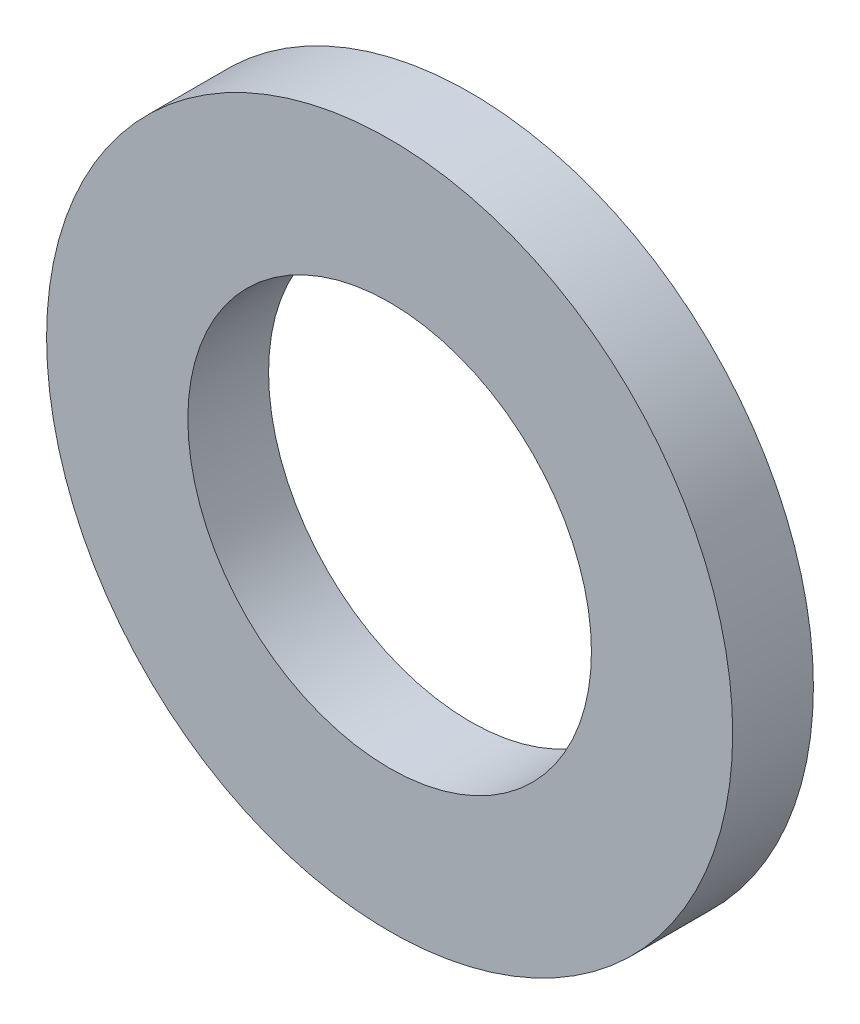
ISO-10303-21;
HEADER;
FILE_DESCRIPTION(('STEP AP214'),'2;1');
FILE_NAME('part.step','',(''),(''),'','','');
FILE_SCHEMA(('AUTOMOTIVE_DESIGN { 1 0 10303 214 1 1 1 1 }'));
ENDSEC;
DATA;
#1=APPLICATION_CONTEXT('core data for automotive mechanical design processes');
#2=APPLICATION_PROTOCOL_DEFINITION('international standard','automotive_design',2000,#1);
#3=PRODUCT_CONTEXT('',#1,'mechanical');
#4=PRODUCT('Part','Part','',(#3));
#5=PRODUCT_RELATED_PRODUCT_CATEGORY('part','',(#4));
#6=PRODUCT_DEFINITION_FORMATION('','',#4);
#7=PRODUCT_DEFINITION_CONTEXT('part definition',#1,'design');
#8=PRODUCT_DEFINITION('design','',#6,#7);
#9=PRODUCT_DEFINITION_SHAPE('','',#8);
#10=(LENGTH_UNIT() NAMED_UNIT(*) SI_UNIT(.MILLI.,.METRE.));
#11=(NAMED_UNIT(*) PLANE_ANGLE_UNIT() SI_UNIT($,.RADIAN.));
#12=(NAMED_UNIT(*) SI_UNIT($,.STERADIAN.) SOLID_ANGLE_UNIT());
#13=UNCERTAINTY_MEASURE_WITH_UNIT(LENGTH_MEASURE(1.E-05),#10,'distance_accuracy_value','');
#14=(GEOMETRIC_REPRESENTATION_CONTEXT(3) GLOBAL_UNCERTAINTY_ASSIGNED_CONTEXT((#13)) GLOBAL_UNIT_ASSIGNED_CONTEXT((#10,
#11,#12)) REPRESENTATION_CONTEXT('',''));
#15=CARTESIAN_POINT('',(0.,0.,0.));
#16=DIRECTION('',(0.,0.,1.));
#17=DIRECTION('',(1.,0.,0.));
#18=AXIS2_PLACEMENT_3D('',#15,#16,#17);
#19=CARTESIAN_POINT('',(0.,0.,1.));
#20=DIRECTION('',(0.,0.,1.));
#21=DIRECTION('',(1.,0.,0.));
#22=AXIS2_PLACEMENT_3D('',#19,#20,#21);
#23=PLANE('',#22);
#24=CARTESIAN_POINT('',(0.,0.,1.));
#25=DIRECTION('',(0.,0.,1.));
#26=DIRECTION('',(1.,0.,0.));
#27=AXIS2_PLACEMENT_3D('',#24,#25,#26);
#28=CIRCLE('',#27,4.25);
#29=CARTESIAN_POINT('',(4.25,0.,1.));
#30=VERTEX_POINT('',#29);
#31=EDGE_CURVE('E10',#30,#30,#28,.T.);
#32=ORIENTED_EDGE('',*,*,#31,.T.);
#33=EDGE_LOOP('',(#32));
#34=FACE_BOUND('',#33,.T.);
#35=CARTESIAN_POINT('',(0.,0.,1.));
#36=DIRECTION('',(0.,0.,1.));
#37=DIRECTION('',(1.,0.,0.));
#38=AXIS2_PLACEMENT_3D('',#35,#36,#37);
#39=CIRCLE('',#38,2.5);
#40=CARTESIAN_POINT('',(2.5,0.,1.));
#41=VERTEX_POINT('',#40);
#42=EDGE_CURVE('E35',#41,#41,#39,.T.);
#43=ORIENTED_EDGE('',*,*,#42,.F.);
#44=EDGE_LOOP('',(#43));
#45=FACE_BOUND('',#44,.T.);
#46=ADVANCED_FACE('F24',(#34,#45),#23,.T.);
#47=CARTESIAN_POINT('',(0.,0.,0.));
#48=DIRECTION('',(0.,0.,1.));
#49=DIRECTION('',(1.,0.,0.));
#50=AXIS2_PLACEMENT_3D('',#47,#48,#49);
#51=PLANE('',#50);
#52=CARTESIAN_POINT('',(0.,0.,0.));
#53=DIRECTION('',(0.,0.,1.));
#54=DIRECTION('',(1.,0.,0.));
#55=AXIS2_PLACEMENT_3D('',#52,#53,#54);
#56=CIRCLE('',#55,4.25);
#57=CARTESIAN_POINT('',(4.25,0.,0.));
#58=VERTEX_POINT('',#57);
#59=EDGE_CURVE('E31',#58,#58,#56,.T.);
#60=ORIENTED_EDGE('',*,*,#59,.F.);
#61=EDGE_LOOP('',(#60));
#62=FACE_BOUND('',#61,.T.);
#63=CARTESIAN_POINT('',(0.,0.,0.));
#64=DIRECTION('',(0.,0.,1.));
#65=DIRECTION('',(1.,0.,0.));
#66=AXIS2_PLACEMENT_3D('',#63,#64,#65);
#67=CIRCLE('',#66,2.5);
#68=CARTESIAN_POINT('',(2.5,0.,0.));
#69=VERTEX_POINT('',#68);
#70=EDGE_CURVE('E39',#69,#69,#67,.T.);
#71=ORIENTED_EDGE('',*,*,#70,.T.);
#72=EDGE_LOOP('',(#71));
#73=FACE_BOUND('',#72,.T.);
#74=ADVANCED_FACE('F45',(#62,#73),#51,.F.);
#75=CARTESIAN_POINT('',(0.,0.,1.));
#76=DIRECTION('',(0.,0.,-1.));
#77=DIRECTION('',(-1.,0.,0.));
#78=AXIS2_PLACEMENT_3D('',#75,#76,#77);
#79=CYLINDRICAL_SURFACE('',#78,4.25);
#80=ORIENTED_EDGE('',*,*,#31,.F.);
#81=EDGE_LOOP('',(#80));
#82=FACE_BOUND('',#81,.T.);
#83=ORIENTED_EDGE('',*,*,#59,.T.);
#84=EDGE_LOOP('',(#83));
#85=FACE_BOUND('',#84,.T.);
#86=ADVANCED_FACE('F26',(#82,#85),#79,.T.);
#87=CARTESIAN_POINT('',(0.,0.,1.));
#88=DIRECTION('',(0.,0.,-1.));
#89=DIRECTION('',(-1.,0.,0.));
#90=AXIS2_PLACEMENT_3D('',#87,#88,#89);
#91=CYLINDRICAL_SURFACE('',#90,2.5);
#92=ORIENTED_EDGE('',*,*,#42,.T.);
#93=EDGE_LOOP('',(#92));
#94=FACE_BOUND('',#93,.T.);
#95=ORIENTED_EDGE('',*,*,#70,.F.);
#96=EDGE_LOOP('',(#95));
#97=FACE_BOUND('',#96,.T.);
#98=ADVANCED_FACE('F47',(#94,#97),#91,.F.);
#99=CLOSED_SHELL('',(#46,#74,#86,#98));
#100=MANIFOLD_SOLID_BREP('B2',#99);
#101=ADVANCED_BREP_SHAPE_REPRESENTATION('',(#18,#100),#14);
#102=SHAPE_DEFINITION_REPRESENTATION(#9,#101);
ENDSEC;
END-ISO-10303-21;
